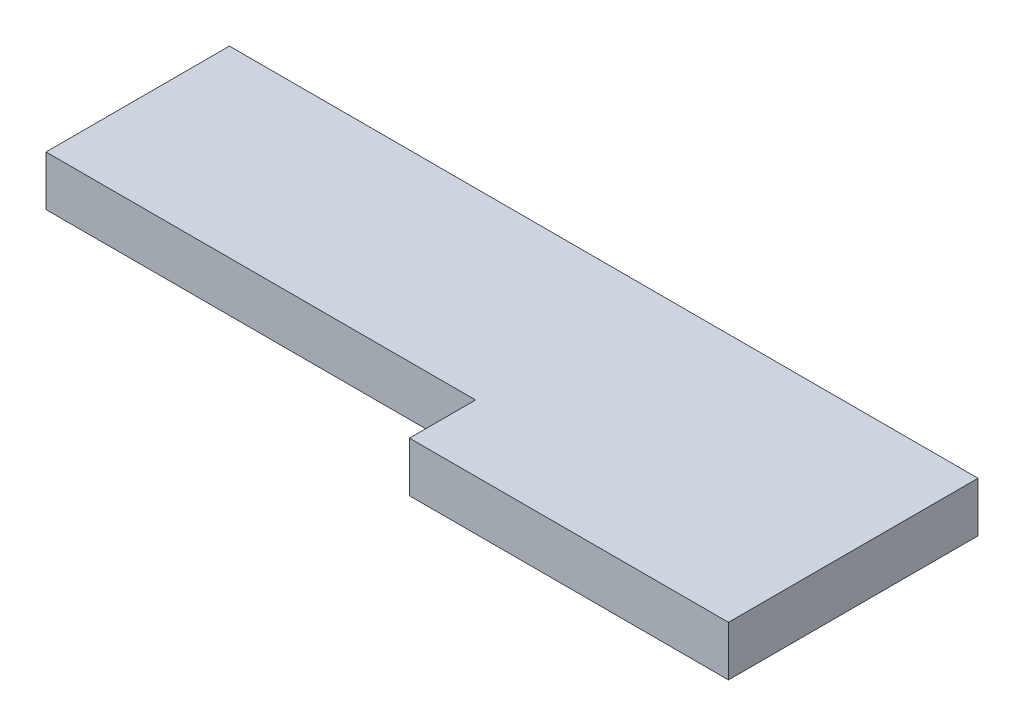
ISO-10303-21;
HEADER;
FILE_DESCRIPTION(('STEP AP214'),'2;1');
FILE_NAME('part.step','',(''),(''),'','','');
FILE_SCHEMA(('AUTOMOTIVE_DESIGN { 1 0 10303 214 1 1 1 1 }'));
ENDSEC;
DATA;
#1=APPLICATION_CONTEXT('core data for automotive mechanical design processes');
#2=APPLICATION_PROTOCOL_DEFINITION('international standard','automotive_design',2000,#1);
#3=PRODUCT_CONTEXT('',#1,'mechanical');
#4=PRODUCT('Part','Part','',(#3));
#5=PRODUCT_RELATED_PRODUCT_CATEGORY('part','',(#4));
#6=PRODUCT_DEFINITION_FORMATION('','',#4);
#7=PRODUCT_DEFINITION_CONTEXT('part definition',#1,'design');
#8=PRODUCT_DEFINITION('design','',#6,#7);
#9=PRODUCT_DEFINITION_SHAPE('','',#8);
#10=(LENGTH_UNIT() NAMED_UNIT(*) SI_UNIT(.MILLI.,.METRE.));
#11=(NAMED_UNIT(*) PLANE_ANGLE_UNIT() SI_UNIT($,.RADIAN.));
#12=(NAMED_UNIT(*) SI_UNIT($,.STERADIAN.) SOLID_ANGLE_UNIT());
#13=UNCERTAINTY_MEASURE_WITH_UNIT(LENGTH_MEASURE(1.E-05),#10,'distance_accuracy_value','');
#14=(GEOMETRIC_REPRESENTATION_CONTEXT(3) GLOBAL_UNCERTAINTY_ASSIGNED_CONTEXT((#13)) GLOBAL_UNIT_ASSIGNED_CONTEXT((#10,
#11,#12)) REPRESENTATION_CONTEXT('',''));
#15=CARTESIAN_POINT('',(0.,0.,0.));
#16=DIRECTION('',(0.,0.,1.));
#17=DIRECTION('',(1.,0.,0.));
#18=AXIS2_PLACEMENT_3D('',#15,#16,#17);
#19=CARTESIAN_POINT('',(26.086956521739,10.,0.951086956521711));
#20=DIRECTION('',(0.,0.,1.));
#21=DIRECTION('',(1.,0.,0.));
#22=AXIS2_PLACEMENT_3D('',#19,#20,#21);
#23=PLANE('',#22);
#24=DIRECTION('',(-1.,0.,0.));
#25=VECTOR('',#24,1.);
#26=CARTESIAN_POINT('',(26.086956521739,0.,0.951086956521711));
#27=LINE('',#26,#25);
#28=CARTESIAN_POINT('',(26.086956521739,0.,0.951086956521711));
#29=VERTEX_POINT('',#28);
#30=CARTESIAN_POINT('',(-123.913043478261,0.,0.95108695652173));
#31=VERTEX_POINT('',#30);
#32=EDGE_CURVE('E128',#29,#31,#27,.T.);
#33=ORIENTED_EDGE('',*,*,#32,.T.);
#34=DIRECTION('',(0.,-1.,0.));
#35=VECTOR('',#34,1.);
#36=CARTESIAN_POINT('',(-123.913043478261,10.,0.95108695652173));
#37=LINE('',#36,#35);
#38=CARTESIAN_POINT('',(-123.913043478261,10.,0.95108695652173));
#39=VERTEX_POINT('',#38);
#40=EDGE_CURVE('E11',#39,#31,#37,.T.);
#41=ORIENTED_EDGE('',*,*,#40,.F.);
#42=DIRECTION('',(-1.,0.,0.));
#43=VECTOR('',#42,1.);
#44=CARTESIAN_POINT('',(26.086956521739,10.,0.951086956521711));
#45=LINE('',#44,#43);
#46=CARTESIAN_POINT('',(26.086956521739,10.,0.951086956521711));
#47=VERTEX_POINT('',#46);
#48=EDGE_CURVE('E144',#47,#39,#45,.T.);
#49=ORIENTED_EDGE('',*,*,#48,.F.);
#50=DIRECTION('',(0.,-1.,0.));
#51=VECTOR('',#50,1.);
#52=CARTESIAN_POINT('',(26.086956521739,10.,0.951086956521711));
#53=LINE('',#52,#51);
#54=EDGE_CURVE('E124',#47,#29,#53,.T.);
#55=ORIENTED_EDGE('',*,*,#54,.T.);
#56=EDGE_LOOP('',(#33,#41,#49,#55));
#57=FACE_BOUND('',#56,.T.);
#58=ADVANCED_FACE('F39',(#57),#23,.F.);
#59=CARTESIAN_POINT('',(-123.913043478261,10.,0.95108695652173));
#60=DIRECTION('',(1.,0.,0.));
#61=DIRECTION('',(0.,0.,-1.));
#62=AXIS2_PLACEMENT_3D('',#59,#60,#61);
#63=PLANE('',#62);
#64=DIRECTION('',(0.,0.,1.));
#65=VECTOR('',#64,1.);
#66=CARTESIAN_POINT('',(-123.913043478261,0.,0.95108695652173));
#67=LINE('',#66,#65);
#68=CARTESIAN_POINT('',(-123.913043478261,0.,37.7072921566989));
#69=VERTEX_POINT('',#68);
#70=EDGE_CURVE('E132',#31,#69,#67,.T.);
#71=ORIENTED_EDGE('',*,*,#70,.T.);
#72=DIRECTION('',(0.,-1.,0.));
#73=VECTOR('',#72,1.);
#74=CARTESIAN_POINT('',(-123.913043478261,10.,37.7072921566989));
#75=LINE('',#74,#73);
#76=CARTESIAN_POINT('',(-123.913043478261,10.,37.7072921566989));
#77=VERTEX_POINT('',#76);
#78=EDGE_CURVE('E48',#77,#69,#75,.T.);
#79=ORIENTED_EDGE('',*,*,#78,.F.);
#80=DIRECTION('',(0.,0.,1.));
#81=VECTOR('',#80,1.);
#82=CARTESIAN_POINT('',(-123.913043478261,10.,0.95108695652173));
#83=LINE('',#82,#81);
#84=EDGE_CURVE('E93',#39,#77,#83,.T.);
#85=ORIENTED_EDGE('',*,*,#84,.F.);
#86=ORIENTED_EDGE('',*,*,#40,.T.);
#87=EDGE_LOOP('',(#71,#79,#85,#86));
#88=FACE_BOUND('',#87,.T.);
#89=ADVANCED_FACE('F172',(#88),#63,.F.);
#90=CARTESIAN_POINT('',(-123.913043478261,10.,37.7072921566989));
#91=DIRECTION('',(0.,0.,-1.));
#92=DIRECTION('',(-1.,0.,0.));
#93=AXIS2_PLACEMENT_3D('',#90,#91,#92);
#94=PLANE('',#93);
#95=DIRECTION('',(1.,0.,0.));
#96=VECTOR('',#95,1.);
#97=CARTESIAN_POINT('',(-123.913043478261,0.,37.7072921566989));
#98=LINE('',#97,#96);
#99=CARTESIAN_POINT('',(-37.8368704802614,0.,37.7072921566989));
#100=VERTEX_POINT('',#99);
#101=EDGE_CURVE('E135',#69,#100,#98,.T.);
#102=ORIENTED_EDGE('',*,*,#101,.T.);
#103=DIRECTION('',(0.,-1.,0.));
#104=VECTOR('',#103,1.);
#105=CARTESIAN_POINT('',(-37.8368704802614,10.,37.7072921566989));
#106=LINE('',#105,#104);
#107=CARTESIAN_POINT('',(-37.8368704802614,10.,37.7072921566989));
#108=VERTEX_POINT('',#107);
#109=EDGE_CURVE('E117',#108,#100,#106,.T.);
#110=ORIENTED_EDGE('',*,*,#109,.F.);
#111=DIRECTION('',(1.,0.,0.));
#112=VECTOR('',#111,1.);
#113=CARTESIAN_POINT('',(-123.913043478261,10.,37.7072921566989));
#114=LINE('',#113,#112);
#115=EDGE_CURVE('E106',#77,#108,#114,.T.);
#116=ORIENTED_EDGE('',*,*,#115,.F.);
#117=ORIENTED_EDGE('',*,*,#78,.T.);
#118=EDGE_LOOP('',(#102,#110,#116,#117));
#119=FACE_BOUND('',#118,.T.);
#120=ADVANCED_FACE('F154',(#119),#94,.F.);
#121=CARTESIAN_POINT('',(-37.8368704802614,10.,37.7072921566989));
#122=DIRECTION('',(1.,0.,0.));
#123=DIRECTION('',(0.,0.,-1.));
#124=AXIS2_PLACEMENT_3D('',#121,#122,#123);
#125=PLANE('',#124);
#126=DIRECTION('',(0.,0.,1.));
#127=VECTOR('',#126,1.);
#128=CARTESIAN_POINT('',(-37.8368704802614,0.,37.7072921566989));
#129=LINE('',#128,#127);
#130=CARTESIAN_POINT('',(-37.8368704802614,0.,50.9510869565217));
#131=VERTEX_POINT('',#130);
#132=EDGE_CURVE('E115',#100,#131,#129,.T.);
#133=ORIENTED_EDGE('',*,*,#132,.T.);
#134=DIRECTION('',(0.,-1.,0.));
#135=VECTOR('',#134,1.);
#136=CARTESIAN_POINT('',(-37.8368704802614,10.,50.9510869565217));
#137=LINE('',#136,#135);
#138=CARTESIAN_POINT('',(-37.8368704802614,10.,50.9510869565217));
#139=VERTEX_POINT('',#138);
#140=EDGE_CURVE('E112',#139,#131,#137,.T.);
#141=ORIENTED_EDGE('',*,*,#140,.F.);
#142=DIRECTION('',(0.,0.,1.));
#143=VECTOR('',#142,1.);
#144=CARTESIAN_POINT('',(-37.8368704802614,10.,37.7072921566989));
#145=LINE('',#144,#143);
#146=EDGE_CURVE('E100',#108,#139,#145,.T.);
#147=ORIENTED_EDGE('',*,*,#146,.F.);
#148=ORIENTED_EDGE('',*,*,#109,.T.);
#149=EDGE_LOOP('',(#133,#141,#147,#148));
#150=FACE_BOUND('',#149,.T.);
#151=ADVANCED_FACE('F113',(#150),#125,.F.);
#152=CARTESIAN_POINT('',(-37.8368704802614,10.,50.9510869565217));
#153=DIRECTION('',(0.,0.,-1.));
#154=DIRECTION('',(-1.,0.,0.));
#155=AXIS2_PLACEMENT_3D('',#152,#153,#154);
#156=PLANE('',#155);
#157=DIRECTION('',(1.,0.,0.));
#158=VECTOR('',#157,1.);
#159=CARTESIAN_POINT('',(-37.8368704802614,0.,50.9510869565217));
#160=LINE('',#159,#158);
#161=CARTESIAN_POINT('',(26.086956521739,0.,50.9510869565217));
#162=VERTEX_POINT('',#161);
#163=EDGE_CURVE('E79',#131,#162,#160,.T.);
#164=ORIENTED_EDGE('',*,*,#163,.T.);
#165=DIRECTION('',(0.,-1.,0.));
#166=VECTOR('',#165,1.);
#167=CARTESIAN_POINT('',(26.086956521739,10.,50.9510869565217));
#168=LINE('',#167,#166);
#169=CARTESIAN_POINT('',(26.086956521739,10.,50.9510869565217));
#170=VERTEX_POINT('',#169);
#171=EDGE_CURVE('E118',#170,#162,#168,.T.);
#172=ORIENTED_EDGE('',*,*,#171,.F.);
#173=DIRECTION('',(1.,0.,0.));
#174=VECTOR('',#173,1.);
#175=CARTESIAN_POINT('',(-37.8368704802614,10.,50.9510869565217));
#176=LINE('',#175,#174);
#177=EDGE_CURVE('E104',#139,#170,#176,.T.);
#178=ORIENTED_EDGE('',*,*,#177,.F.);
#179=ORIENTED_EDGE('',*,*,#140,.T.);
#180=EDGE_LOOP('',(#164,#172,#178,#179));
#181=FACE_BOUND('',#180,.T.);
#182=ADVANCED_FACE('F120',(#181),#156,.F.);
#183=CARTESIAN_POINT('',(26.086956521739,10.,50.9510869565217));
#184=DIRECTION('',(-1.,0.,0.));
#185=DIRECTION('',(0.,0.,1.));
#186=AXIS2_PLACEMENT_3D('',#183,#184,#185);
#187=PLANE('',#186);
#188=DIRECTION('',(0.,0.,-1.));
#189=VECTOR('',#188,1.);
#190=CARTESIAN_POINT('',(26.086956521739,0.,50.9510869565217));
#191=LINE('',#190,#189);
#192=EDGE_CURVE('E85',#162,#29,#191,.T.);
#193=ORIENTED_EDGE('',*,*,#192,.T.);
#194=ORIENTED_EDGE('',*,*,#54,.F.);
#195=DIRECTION('',(0.,0.,-1.));
#196=VECTOR('',#195,1.);
#197=CARTESIAN_POINT('',(26.086956521739,10.,50.9510869565217));
#198=LINE('',#197,#196);
#199=EDGE_CURVE('E56',#170,#47,#198,.T.);
#200=ORIENTED_EDGE('',*,*,#199,.F.);
#201=ORIENTED_EDGE('',*,*,#171,.T.);
#202=EDGE_LOOP('',(#193,#194,#200,#201));
#203=FACE_BOUND('',#202,.T.);
#204=ADVANCED_FACE('F161',(#203),#187,.F.);
#205=CARTESIAN_POINT('',(0.,10.,0.));
#206=DIRECTION('',(0.,1.,0.));
#207=DIRECTION('',(0.,0.,1.));
#208=AXIS2_PLACEMENT_3D('',#205,#206,#207);
#209=PLANE('',#208);
#210=ORIENTED_EDGE('',*,*,#48,.T.);
#211=ORIENTED_EDGE('',*,*,#84,.T.);
#212=ORIENTED_EDGE('',*,*,#115,.T.);
#213=ORIENTED_EDGE('',*,*,#146,.T.);
#214=ORIENTED_EDGE('',*,*,#177,.T.);
#215=ORIENTED_EDGE('',*,*,#199,.T.);
#216=EDGE_LOOP('',(#210,#211,#212,#213,#214,#215));
#217=FACE_BOUND('',#216,.T.);
#218=ADVANCED_FACE('F102',(#217),#209,.T.);
#219=CARTESIAN_POINT('',(0.,0.,0.));
#220=DIRECTION('',(0.,1.,0.));
#221=DIRECTION('',(0.,0.,1.));
#222=AXIS2_PLACEMENT_3D('',#219,#220,#221);
#223=PLANE('',#222);
#224=ORIENTED_EDGE('',*,*,#32,.F.);
#225=ORIENTED_EDGE('',*,*,#192,.F.);
#226=ORIENTED_EDGE('',*,*,#163,.F.);
#227=ORIENTED_EDGE('',*,*,#132,.F.);
#228=ORIENTED_EDGE('',*,*,#101,.F.);
#229=ORIENTED_EDGE('',*,*,#70,.F.);
#230=EDGE_LOOP('',(#224,#225,#226,#227,#228,#229));
#231=FACE_BOUND('',#230,.T.);
#232=ADVANCED_FACE('F157',(#231),#223,.F.);
#233=CLOSED_SHELL('',(#58,#89,#120,#151,#182,#204,#218,#232));
#234=MANIFOLD_SOLID_BREP('B2',#233);
#235=ADVANCED_BREP_SHAPE_REPRESENTATION('',(#18,#234),#14);
#236=SHAPE_DEFINITION_REPRESENTATION(#9,#235);
ENDSEC;
END-ISO-10303-21;
